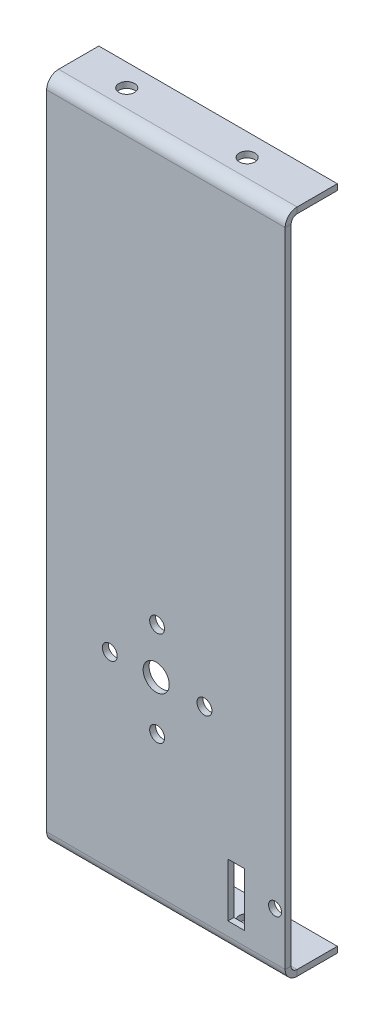
ISO-10303-21;
HEADER;
FILE_DESCRIPTION(('STEP AP214'),'2;1');
FILE_NAME('part.step','',(''),(''),'','','');
FILE_SCHEMA(('AUTOMOTIVE_DESIGN { 1 0 10303 214 1 1 1 1 }'));
ENDSEC;
DATA;
#1=APPLICATION_CONTEXT('core data for automotive mechanical design processes');
#2=APPLICATION_PROTOCOL_DEFINITION('international standard','automotive_design',2000,#1);
#3=PRODUCT_CONTEXT('',#1,'mechanical');
#4=PRODUCT('Part','Part','',(#3));
#5=PRODUCT_RELATED_PRODUCT_CATEGORY('part','',(#4));
#6=PRODUCT_DEFINITION_FORMATION('','',#4);
#7=PRODUCT_DEFINITION_CONTEXT('part definition',#1,'design');
#8=PRODUCT_DEFINITION('design','',#6,#7);
#9=PRODUCT_DEFINITION_SHAPE('','',#8);
#10=(LENGTH_UNIT() NAMED_UNIT(*) SI_UNIT(.MILLI.,.METRE.));
#11=(NAMED_UNIT(*) PLANE_ANGLE_UNIT() SI_UNIT($,.RADIAN.));
#12=(NAMED_UNIT(*) SI_UNIT($,.STERADIAN.) SOLID_ANGLE_UNIT());
#13=UNCERTAINTY_MEASURE_WITH_UNIT(LENGTH_MEASURE(1.E-05),#10,'distance_accuracy_value','');
#14=(GEOMETRIC_REPRESENTATION_CONTEXT(3) GLOBAL_UNCERTAINTY_ASSIGNED_CONTEXT((#13)) GLOBAL_UNIT_ASSIGNED_CONTEXT((#10,
#11,#12)) REPRESENTATION_CONTEXT('',''));
#15=CARTESIAN_POINT('',(0.,0.,0.));
#16=DIRECTION('',(0.,0.,1.));
#17=DIRECTION('',(1.,0.,0.));
#18=AXIS2_PLACEMENT_3D('',#15,#16,#17);
#19=CARTESIAN_POINT('',(0.,0.,-1.6));
#20=DIRECTION('',(0.,0.,-1.));
#21=DIRECTION('',(-1.,0.,0.));
#22=AXIS2_PLACEMENT_3D('',#19,#20,#21);
#23=PLANE('',#22);
#24=DIRECTION('',(0.,1.,0.));
#25=VECTOR('',#24,1.);
#26=CARTESIAN_POINT('',(48.6419969295721,0.,-1.6));
#27=LINE('',#26,#25);
#28=CARTESIAN_POINT('',(48.6419969295721,6.80327818943664,-1.6));
#29=VERTEX_POINT('',#28);
#30=CARTESIAN_POINT('',(48.6419969295721,21.1762425645532,-1.6));
#31=VERTEX_POINT('',#30);
#32=EDGE_CURVE('E226',#29,#31,#27,.T.);
#33=ORIENTED_EDGE('',*,*,#32,.F.);
#34=DIRECTION('',(-1.,0.,0.));
#35=VECTOR('',#34,1.);
#36=CARTESIAN_POINT('',(0.,6.80327818943664,-1.6));
#37=LINE('',#36,#35);
#38=CARTESIAN_POINT('',(53.1404056271276,6.80327818943664,-1.6));
#39=VERTEX_POINT('',#38);
#40=EDGE_CURVE('E219',#39,#29,#37,.T.);
#41=ORIENTED_EDGE('',*,*,#40,.F.);
#42=DIRECTION('',(0.,-1.,0.));
#43=VECTOR('',#42,1.);
#44=CARTESIAN_POINT('',(53.1404056271276,0.,-1.6));
#45=LINE('',#44,#43);
#46=CARTESIAN_POINT('',(53.1404056271276,21.1762425645532,-1.6));
#47=VERTEX_POINT('',#46);
#48=EDGE_CURVE('E199',#47,#39,#45,.T.);
#49=ORIENTED_EDGE('',*,*,#48,.F.);
#50=DIRECTION('',(1.,0.,0.));
#51=VECTOR('',#50,1.);
#52=CARTESIAN_POINT('',(0.,21.1762425645532,-1.6));
#53=LINE('',#52,#51);
#54=EDGE_CURVE('E224',#31,#47,#53,.T.);
#55=ORIENTED_EDGE('',*,*,#54,.F.);
#56=EDGE_LOOP('',(#33,#41,#49,#55));
#57=FACE_BOUND('',#56,.T.);
#58=CARTESIAN_POINT('',(29.384576346946,53.8122055407926,-1.6));
#59=DIRECTION('',(0.,0.,-1.));
#60=DIRECTION('',(-1.,0.,0.));
#61=AXIS2_PLACEMENT_3D('',#58,#59,#60);
#62=CIRCLE('',#61,3.5000000000002);
#63=CARTESIAN_POINT('',(25.8845763469458,53.8122055407926,-1.6));
#64=VERTEX_POINT('',#63);
#65=EDGE_CURVE('E231',#64,#64,#62,.T.);
#66=ORIENTED_EDGE('',*,*,#65,.F.);
#67=EDGE_LOOP('',(#66));
#68=FACE_BOUND('',#67,.T.);
#69=CARTESIAN_POINT('',(61.2911821742671,15.9999999999998,-1.60000000000005));
#70=DIRECTION('',(0.,0.,-1.));
#71=DIRECTION('',(-1.,0.,0.));
#72=AXIS2_PLACEMENT_3D('',#69,#70,#71);
#73=CIRCLE('',#72,1.75);
#74=CARTESIAN_POINT('',(59.5411821742671,15.9999999999998,-1.60000000000005));
#75=VERTEX_POINT('',#74);
#76=EDGE_CURVE('E261',#75,#75,#73,.T.);
#77=ORIENTED_EDGE('',*,*,#76,.F.);
#78=EDGE_LOOP('',(#77));
#79=FACE_BOUND('',#78,.T.);
#80=CARTESIAN_POINT('',(29.6396852912716,66.1685636075182,-1.60000000000005));
#81=DIRECTION('',(0.,0.,-1.));
#82=DIRECTION('',(-1.,0.,0.));
#83=AXIS2_PLACEMENT_3D('',#80,#81,#82);
#84=CIRCLE('',#83,2.);
#85=CARTESIAN_POINT('',(27.6396852912717,66.1685636075182,-1.60000000000005));
#86=VERTEX_POINT('',#85);
#87=EDGE_CURVE('E258',#86,#86,#84,.T.);
#88=ORIENTED_EDGE('',*,*,#87,.F.);
#89=EDGE_LOOP('',(#88));
#90=FACE_BOUND('',#89,.T.);
#91=CARTESIAN_POINT('',(16.9396852912716,53.4685636075182,-1.60000000000005));
#92=DIRECTION('',(0.,0.,-1.));
#93=DIRECTION('',(-1.,0.,0.));
#94=AXIS2_PLACEMENT_3D('',#91,#92,#93);
#95=CIRCLE('',#94,2.);
#96=CARTESIAN_POINT('',(14.9396852912716,53.4685636075182,-1.60000000000005));
#97=VERTEX_POINT('',#96);
#98=EDGE_CURVE('E255',#97,#97,#95,.T.);
#99=ORIENTED_EDGE('',*,*,#98,.F.);
#100=EDGE_LOOP('',(#99));
#101=FACE_BOUND('',#100,.T.);
#102=CARTESIAN_POINT('',(42.3396852912716,53.4685636075182,-1.60000000000005));
#103=DIRECTION('',(0.,0.,-1.));
#104=DIRECTION('',(-1.,0.,0.));
#105=AXIS2_PLACEMENT_3D('',#102,#103,#104);
#106=CIRCLE('',#105,2.);
#107=CARTESIAN_POINT('',(40.3396852912716,53.4685636075182,-1.60000000000005));
#108=VERTEX_POINT('',#107);
#109=EDGE_CURVE('E252',#108,#108,#106,.T.);
#110=ORIENTED_EDGE('',*,*,#109,.F.);
#111=EDGE_LOOP('',(#110));
#112=FACE_BOUND('',#111,.T.);
#113=CARTESIAN_POINT('',(29.6396852912716,40.7685636075182,-1.60000000000005));
#114=DIRECTION('',(0.,0.,-1.));
#115=DIRECTION('',(-1.,0.,0.));
#116=AXIS2_PLACEMENT_3D('',#113,#114,#115);
#117=CIRCLE('',#116,2.);
#118=CARTESIAN_POINT('',(27.6396852912717,40.7685636075182,-1.60000000000005));
#119=VERTEX_POINT('',#118);
#120=EDGE_CURVE('E238',#119,#119,#117,.T.);
#121=ORIENTED_EDGE('',*,*,#120,.F.);
#122=EDGE_LOOP('',(#121));
#123=FACE_BOUND('',#122,.T.);
#124=DIRECTION('',(0.,-1.,0.));
#125=VECTOR('',#124,1.);
#126=CARTESIAN_POINT('',(0.,0.,-1.6));
#127=LINE('',#126,#125);
#128=CARTESIAN_POINT('',(0.,175.6,-1.6));
#129=VERTEX_POINT('',#128);
#130=CARTESIAN_POINT('',(0.,3.19999999999999,-1.6));
#131=VERTEX_POINT('',#130);
#132=EDGE_CURVE('E87',#129,#131,#127,.T.);
#133=ORIENTED_EDGE('',*,*,#132,.F.);
#134=DIRECTION('',(1.,0.,0.));
#135=VECTOR('',#134,1.);
#136=CARTESIAN_POINT('',(64.,175.6,-1.6));
#137=LINE('',#136,#135);
#138=CARTESIAN_POINT('',(64.,175.6,-1.6));
#139=VERTEX_POINT('',#138);
#140=EDGE_CURVE('E326',#139,#129,#137,.F.);
#141=ORIENTED_EDGE('',*,*,#140,.F.);
#142=DIRECTION('',(0.,1.,0.));
#143=VECTOR('',#142,1.);
#144=CARTESIAN_POINT('',(64.,0.,-1.6));
#145=LINE('',#144,#143);
#146=CARTESIAN_POINT('',(64.,3.19999999999999,-1.6));
#147=VERTEX_POINT('',#146);
#148=EDGE_CURVE('E13',#147,#139,#145,.T.);
#149=ORIENTED_EDGE('',*,*,#148,.F.);
#150=DIRECTION('',(-1.,0.,0.));
#151=VECTOR('',#150,1.);
#152=CARTESIAN_POINT('',(0.,3.19999999999999,-1.6));
#153=LINE('',#152,#151);
#154=EDGE_CURVE('E379',#131,#147,#153,.F.);
#155=ORIENTED_EDGE('',*,*,#154,.F.);
#156=EDGE_LOOP('',(#133,#141,#149,#155));
#157=FACE_BOUND('',#156,.T.);
#158=ADVANCED_FACE('F78',(#57,#68,#79,#90,#101,#112,#123,#157),#23,.T.);
#159=CARTESIAN_POINT('',(0.,0.,0.));
#160=DIRECTION('',(0.,0.,-1.));
#161=DIRECTION('',(-1.,0.,0.));
#162=AXIS2_PLACEMENT_3D('',#159,#160,#161);
#163=PLANE('',#162);
#164=DIRECTION('',(1.,0.,0.));
#165=VECTOR('',#164,1.);
#166=CARTESIAN_POINT('',(48.6419969295721,6.80327818943664,0.));
#167=LINE('',#166,#165);
#168=CARTESIAN_POINT('',(48.6419969295721,6.80327818943664,0.));
#169=VERTEX_POINT('',#168);
#170=CARTESIAN_POINT('',(53.1404056271276,6.80327818943664,0.));
#171=VERTEX_POINT('',#170);
#172=EDGE_CURVE('E205',#169,#171,#167,.T.);
#173=ORIENTED_EDGE('',*,*,#172,.F.);
#174=DIRECTION('',(0.,-1.,0.));
#175=VECTOR('',#174,1.);
#176=CARTESIAN_POINT('',(48.6419969295721,21.1762425645532,0.));
#177=LINE('',#176,#175);
#178=CARTESIAN_POINT('',(48.6419969295721,21.1762425645532,0.));
#179=VERTEX_POINT('',#178);
#180=EDGE_CURVE('E103',#179,#169,#177,.T.);
#181=ORIENTED_EDGE('',*,*,#180,.F.);
#182=DIRECTION('',(-1.,0.,0.));
#183=VECTOR('',#182,1.);
#184=CARTESIAN_POINT('',(48.6419969295721,21.1762425645532,0.));
#185=LINE('',#184,#183);
#186=CARTESIAN_POINT('',(53.1404056271276,21.1762425645532,0.));
#187=VERTEX_POINT('',#186);
#188=EDGE_CURVE('E212',#187,#179,#185,.T.);
#189=ORIENTED_EDGE('',*,*,#188,.F.);
#190=DIRECTION('',(0.,1.,0.));
#191=VECTOR('',#190,1.);
#192=CARTESIAN_POINT('',(53.1404056271276,21.1762425645532,0.));
#193=LINE('',#192,#191);
#194=EDGE_CURVE('E196',#171,#187,#193,.T.);
#195=ORIENTED_EDGE('',*,*,#194,.F.);
#196=EDGE_LOOP('',(#173,#181,#189,#195));
#197=FACE_BOUND('',#196,.T.);
#198=CARTESIAN_POINT('',(29.384576346946,53.8122055407926,0.));
#199=DIRECTION('',(0.,0.,1.));
#200=DIRECTION('',(1.,0.,0.));
#201=AXIS2_PLACEMENT_3D('',#198,#199,#200);
#202=CIRCLE('',#201,3.5000000000002);
#203=CARTESIAN_POINT('',(32.8845763469462,53.8122055407926,0.));
#204=VERTEX_POINT('',#203);
#205=EDGE_CURVE('E228',#204,#204,#202,.T.);
#206=ORIENTED_EDGE('',*,*,#205,.F.);
#207=EDGE_LOOP('',(#206));
#208=FACE_BOUND('',#207,.T.);
#209=CARTESIAN_POINT('',(61.2911821742671,15.9999999999998,0.));
#210=DIRECTION('',(0.,0.,1.));
#211=DIRECTION('',(1.,0.,0.));
#212=AXIS2_PLACEMENT_3D('',#209,#210,#211);
#213=CIRCLE('',#212,1.75);
#214=CARTESIAN_POINT('',(63.0411821742671,15.9999999999998,0.));
#215=VERTEX_POINT('',#214);
#216=EDGE_CURVE('E235',#215,#215,#213,.T.);
#217=ORIENTED_EDGE('',*,*,#216,.F.);
#218=EDGE_LOOP('',(#217));
#219=FACE_BOUND('',#218,.T.);
#220=CARTESIAN_POINT('',(29.6396852912716,66.1685636075182,0.));
#221=DIRECTION('',(0.,0.,1.));
#222=DIRECTION('',(1.,0.,0.));
#223=AXIS2_PLACEMENT_3D('',#220,#221,#222);
#224=CIRCLE('',#223,2.);
#225=CARTESIAN_POINT('',(31.6396852912716,66.1685636075182,0.));
#226=VERTEX_POINT('',#225);
#227=EDGE_CURVE('E234',#226,#226,#224,.T.);
#228=ORIENTED_EDGE('',*,*,#227,.F.);
#229=EDGE_LOOP('',(#228));
#230=FACE_BOUND('',#229,.T.);
#231=CARTESIAN_POINT('',(16.9396852912716,53.4685636075182,0.));
#232=DIRECTION('',(0.,0.,1.));
#233=DIRECTION('',(1.,0.,0.));
#234=AXIS2_PLACEMENT_3D('',#231,#232,#233);
#235=CIRCLE('',#234,2.);
#236=CARTESIAN_POINT('',(18.9396852912716,53.4685636075182,0.));
#237=VERTEX_POINT('',#236);
#238=EDGE_CURVE('E240',#237,#237,#235,.T.);
#239=ORIENTED_EDGE('',*,*,#238,.F.);
#240=EDGE_LOOP('',(#239));
#241=FACE_BOUND('',#240,.T.);
#242=CARTESIAN_POINT('',(42.3396852912716,53.4685636075182,0.));
#243=DIRECTION('',(0.,0.,1.));
#244=DIRECTION('',(1.,0.,0.));
#245=AXIS2_PLACEMENT_3D('',#242,#243,#244);
#246=CIRCLE('',#245,2.);
#247=CARTESIAN_POINT('',(44.3396852912716,53.4685636075182,0.));
#248=VERTEX_POINT('',#247);
#249=EDGE_CURVE('E243',#248,#248,#246,.T.);
#250=ORIENTED_EDGE('',*,*,#249,.F.);
#251=EDGE_LOOP('',(#250));
#252=FACE_BOUND('',#251,.T.);
#253=CARTESIAN_POINT('',(29.6396852912716,40.7685636075182,0.));
#254=DIRECTION('',(0.,0.,1.));
#255=DIRECTION('',(1.,0.,0.));
#256=AXIS2_PLACEMENT_3D('',#253,#254,#255);
#257=CIRCLE('',#256,2.);
#258=CARTESIAN_POINT('',(31.6396852912716,40.7685636075182,0.));
#259=VERTEX_POINT('',#258);
#260=EDGE_CURVE('E239',#259,#259,#257,.T.);
#261=ORIENTED_EDGE('',*,*,#260,.F.);
#262=EDGE_LOOP('',(#261));
#263=FACE_BOUND('',#262,.T.);
#264=DIRECTION('',(1.,0.,0.));
#265=VECTOR('',#264,1.);
#266=CARTESIAN_POINT('',(64.,175.6,0.));
#267=LINE('',#266,#265);
#268=CARTESIAN_POINT('',(64.,175.6,0.));
#269=VERTEX_POINT('',#268);
#270=CARTESIAN_POINT('',(0.,175.6,0.));
#271=VERTEX_POINT('',#270);
#272=EDGE_CURVE('E314',#269,#271,#267,.F.);
#273=ORIENTED_EDGE('',*,*,#272,.T.);
#274=DIRECTION('',(0.,-1.,0.));
#275=VECTOR('',#274,1.);
#276=CARTESIAN_POINT('',(0.,0.,0.));
#277=LINE('',#276,#275);
#278=CARTESIAN_POINT('',(0.,3.19999999999999,0.));
#279=VERTEX_POINT('',#278);
#280=EDGE_CURVE('E387',#271,#279,#277,.T.);
#281=ORIENTED_EDGE('',*,*,#280,.T.);
#282=DIRECTION('',(-1.,0.,0.));
#283=VECTOR('',#282,1.);
#284=CARTESIAN_POINT('',(0.,3.19999999999999,0.));
#285=LINE('',#284,#283);
#286=CARTESIAN_POINT('',(64.,3.19999999999999,0.));
#287=VERTEX_POINT('',#286);
#288=EDGE_CURVE('E367',#279,#287,#285,.F.);
#289=ORIENTED_EDGE('',*,*,#288,.T.);
#290=DIRECTION('',(0.,1.,0.));
#291=VECTOR('',#290,1.);
#292=CARTESIAN_POINT('',(64.,0.,0.));
#293=LINE('',#292,#291);
#294=EDGE_CURVE('E390',#287,#269,#293,.T.);
#295=ORIENTED_EDGE('',*,*,#294,.T.);
#296=EDGE_LOOP('',(#273,#281,#289,#295));
#297=FACE_BOUND('',#296,.T.);
#298=ADVANCED_FACE('F209',(#197,#208,#219,#230,#241,#252,#263,#297),#163,.F.);
#299=CARTESIAN_POINT('',(64.,0.,-1.6));
#300=DIRECTION('',(1.,0.,0.));
#301=DIRECTION('',(0.,0.,-1.));
#302=AXIS2_PLACEMENT_3D('',#299,#300,#301);
#303=PLANE('',#302);
#304=ORIENTED_EDGE('',*,*,#148,.T.);
#305=DIRECTION('',(0.,0.,1.));
#306=VECTOR('',#305,1.);
#307=CARTESIAN_POINT('',(64.,175.6,-1.6));
#308=LINE('',#307,#306);
#309=EDGE_CURVE('E320',#139,#269,#308,.T.);
#310=ORIENTED_EDGE('',*,*,#309,.T.);
#311=ORIENTED_EDGE('',*,*,#294,.F.);
#312=DIRECTION('',(0.,0.,1.));
#313=VECTOR('',#312,1.);
#314=CARTESIAN_POINT('',(64.,3.19999999999999,-1.6));
#315=LINE('',#314,#313);
#316=EDGE_CURVE('E384',#147,#287,#315,.T.);
#317=ORIENTED_EDGE('',*,*,#316,.F.);
#318=EDGE_LOOP('',(#304,#310,#311,#317));
#319=FACE_BOUND('',#318,.T.);
#320=ADVANCED_FACE('F447',(#319),#303,.T.);
#321=CARTESIAN_POINT('',(0.,0.,-1.6));
#322=DIRECTION('',(-1.,0.,0.));
#323=DIRECTION('',(0.,0.,1.));
#324=AXIS2_PLACEMENT_3D('',#321,#322,#323);
#325=PLANE('',#324);
#326=DIRECTION('',(0.,0.,1.));
#327=VECTOR('',#326,1.);
#328=CARTESIAN_POINT('',(0.,175.6,-1.6));
#329=LINE('',#328,#327);
#330=EDGE_CURVE('E331',#129,#271,#329,.T.);
#331=ORIENTED_EDGE('',*,*,#330,.F.);
#332=ORIENTED_EDGE('',*,*,#132,.T.);
#333=DIRECTION('',(0.,0.,1.));
#334=VECTOR('',#333,1.);
#335=CARTESIAN_POINT('',(0.,3.19999999999999,-1.6));
#336=LINE('',#335,#334);
#337=EDGE_CURVE('E373',#131,#279,#336,.T.);
#338=ORIENTED_EDGE('',*,*,#337,.T.);
#339=ORIENTED_EDGE('',*,*,#280,.F.);
#340=EDGE_LOOP('',(#331,#332,#338,#339));
#341=FACE_BOUND('',#340,.T.);
#342=ADVANCED_FACE('F80',(#341),#325,.T.);
#343=CARTESIAN_POINT('',(64.,3.19999999999999,-3.2));
#344=DIRECTION('',(1.,0.,0.));
#345=DIRECTION('',(0.,0.,-1.));
#346=AXIS2_PLACEMENT_3D('',#343,#344,#345);
#347=PLANE('',#346);
#348=DIRECTION('',(0.,1.,0.));
#349=VECTOR('',#348,1.);
#350=CARTESIAN_POINT('',(64.,0.,-3.19999999999999));
#351=LINE('',#350,#349);
#352=CARTESIAN_POINT('',(64.,1.59999999999999,-3.19999999999999));
#353=VERTEX_POINT('',#352);
#354=CARTESIAN_POINT('',(63.9999999999999,0.,-3.19999999999999));
#355=VERTEX_POINT('',#354);
#356=EDGE_CURVE('E334',#353,#355,#351,.F.);
#357=ORIENTED_EDGE('',*,*,#356,.F.);
#358=CARTESIAN_POINT('',(64.,3.19999999999999,-3.2));
#359=DIRECTION('',(-1.,0.,0.));
#360=DIRECTION('',(0.,0.,1.));
#361=AXIS2_PLACEMENT_3D('',#358,#359,#360);
#362=CIRCLE('',#361,1.6);
#363=EDGE_CURVE('E376',#147,#353,#362,.F.);
#364=ORIENTED_EDGE('',*,*,#363,.F.);
#365=ORIENTED_EDGE('',*,*,#316,.T.);
#366=CARTESIAN_POINT('',(63.9999999999999,3.19999999999999,-3.2));
#367=DIRECTION('',(-1.,0.,0.));
#368=DIRECTION('',(0.,0.,1.));
#369=AXIS2_PLACEMENT_3D('',#366,#367,#368);
#370=CIRCLE('',#369,3.2);
#371=EDGE_CURVE('E369',#287,#355,#370,.F.);
#372=ORIENTED_EDGE('',*,*,#371,.T.);
#373=EDGE_LOOP('',(#357,#364,#365,#372));
#374=FACE_BOUND('',#373,.T.);
#375=ADVANCED_FACE('F459',(#374),#347,.T.);
#376=CARTESIAN_POINT('',(0.,3.19999999999999,-3.2));
#377=DIRECTION('',(1.,0.,0.));
#378=DIRECTION('',(0.,0.,-1.));
#379=AXIS2_PLACEMENT_3D('',#376,#377,#378);
#380=PLANE('',#379);
#381=CARTESIAN_POINT('',(0.,3.19999999999999,-3.2));
#382=DIRECTION('',(-1.,0.,0.));
#383=DIRECTION('',(0.,0.,1.));
#384=AXIS2_PLACEMENT_3D('',#381,#382,#383);
#385=CIRCLE('',#384,1.6);
#386=CARTESIAN_POINT('',(0.,1.59999999999999,-3.19999999999999));
#387=VERTEX_POINT('',#386);
#388=EDGE_CURVE('E340',#387,#131,#385,.T.);
#389=ORIENTED_EDGE('',*,*,#388,.F.);
#390=DIRECTION('',(0.,1.,0.));
#391=VECTOR('',#390,1.);
#392=CARTESIAN_POINT('',(0.,1.59999999999999,-3.19999999999999));
#393=LINE('',#392,#391);
#394=CARTESIAN_POINT('',(0.,0.,-3.19999999999999));
#395=VERTEX_POINT('',#394);
#396=EDGE_CURVE('E360',#387,#395,#393,.F.);
#397=ORIENTED_EDGE('',*,*,#396,.T.);
#398=CARTESIAN_POINT('',(0.,3.19999999999999,-3.2));
#399=DIRECTION('',(-1.,0.,0.));
#400=DIRECTION('',(0.,0.,1.));
#401=AXIS2_PLACEMENT_3D('',#398,#399,#400);
#402=CIRCLE('',#401,3.2);
#403=EDGE_CURVE('E370',#395,#279,#402,.T.);
#404=ORIENTED_EDGE('',*,*,#403,.T.);
#405=ORIENTED_EDGE('',*,*,#337,.F.);
#406=EDGE_LOOP('',(#389,#397,#404,#405));
#407=FACE_BOUND('',#406,.T.);
#408=ADVANCED_FACE('F452',(#407),#380,.F.);
#409=CARTESIAN_POINT('',(0.,3.19999999999999,-3.2));
#410=DIRECTION('',(-1.,0.,0.));
#411=DIRECTION('',(0.,-1.,0.));
#412=AXIS2_PLACEMENT_3D('',#409,#410,#411);
#413=CYLINDRICAL_SURFACE('',#412,3.2);
#414=ORIENTED_EDGE('',*,*,#288,.F.);
#415=ORIENTED_EDGE('',*,*,#403,.F.);
#416=DIRECTION('',(-1.,0.,0.));
#417=VECTOR('',#416,1.);
#418=CARTESIAN_POINT('',(64.,0.,-3.19999999999999));
#419=LINE('',#418,#417);
#420=EDGE_CURVE('E358',#395,#355,#419,.F.);
#421=ORIENTED_EDGE('',*,*,#420,.T.);
#422=ORIENTED_EDGE('',*,*,#371,.F.);
#423=EDGE_LOOP('',(#414,#415,#421,#422));
#424=FACE_BOUND('',#423,.T.);
#425=ADVANCED_FACE('F479',(#424),#413,.T.);
#426=CARTESIAN_POINT('',(0.,3.19999999999999,-3.2));
#427=DIRECTION('',(-1.,0.,0.));
#428=DIRECTION('',(0.,-1.,0.));
#429=AXIS2_PLACEMENT_3D('',#426,#427,#428);
#430=CYLINDRICAL_SURFACE('',#429,1.6);
#431=ORIENTED_EDGE('',*,*,#154,.T.);
#432=ORIENTED_EDGE('',*,*,#363,.T.);
#433=DIRECTION('',(-1.,0.,0.));
#434=VECTOR('',#433,1.);
#435=CARTESIAN_POINT('',(64.,1.59999999999999,-3.19999999999999));
#436=LINE('',#435,#434);
#437=EDGE_CURVE('E363',#353,#387,#436,.T.);
#438=ORIENTED_EDGE('',*,*,#437,.T.);
#439=ORIENTED_EDGE('',*,*,#388,.T.);
#440=EDGE_LOOP('',(#431,#432,#438,#439));
#441=FACE_BOUND('',#440,.T.);
#442=ADVANCED_FACE('F500',(#441),#430,.F.);
#443=CARTESIAN_POINT('',(0.,0.,-14.));
#444=DIRECTION('',(1.,0.,0.));
#445=DIRECTION('',(0.,0.,-1.));
#446=AXIS2_PLACEMENT_3D('',#443,#444,#445);
#447=PLANE('',#446);
#448=ORIENTED_EDGE('',*,*,#396,.F.);
#449=DIRECTION('',(0.,0.,1.));
#450=VECTOR('',#449,1.);
#451=CARTESIAN_POINT('',(0.,1.59999999999996,-14.));
#452=LINE('',#451,#450);
#453=CARTESIAN_POINT('',(0.,1.59999999999996,-14.));
#454=VERTEX_POINT('',#453);
#455=EDGE_CURVE('E356',#387,#454,#452,.F.);
#456=ORIENTED_EDGE('',*,*,#455,.T.);
#457=DIRECTION('',(0.,1.,0.));
#458=VECTOR('',#457,1.);
#459=CARTESIAN_POINT('',(0.,0.,-14.));
#460=LINE('',#459,#458);
#461=CARTESIAN_POINT('',(0.,0.,-14.));
#462=VERTEX_POINT('',#461);
#463=EDGE_CURVE('E337',#462,#454,#460,.T.);
#464=ORIENTED_EDGE('',*,*,#463,.F.);
#465=DIRECTION('',(0.,0.,-1.));
#466=VECTOR('',#465,1.);
#467=CARTESIAN_POINT('',(0.,0.,0.));
#468=LINE('',#467,#466);
#469=EDGE_CURVE('E349',#395,#462,#468,.T.);
#470=ORIENTED_EDGE('',*,*,#469,.F.);
#471=EDGE_LOOP('',(#448,#456,#464,#470));
#472=FACE_BOUND('',#471,.T.);
#473=ADVANCED_FACE('F488',(#472),#447,.F.);
#474=CARTESIAN_POINT('',(64.,0.,-1.59999999999999));
#475=DIRECTION('',(-1.,0.,0.));
#476=DIRECTION('',(0.,0.,1.));
#477=AXIS2_PLACEMENT_3D('',#474,#475,#476);
#478=PLANE('',#477);
#479=ORIENTED_EDGE('',*,*,#356,.T.);
#480=DIRECTION('',(0.,0.,1.));
#481=VECTOR('',#480,1.);
#482=CARTESIAN_POINT('',(64.,0.,0.));
#483=LINE('',#482,#481);
#484=CARTESIAN_POINT('',(64.,0.,-14.));
#485=VERTEX_POINT('',#484);
#486=EDGE_CURVE('E344',#485,#355,#483,.T.);
#487=ORIENTED_EDGE('',*,*,#486,.F.);
#488=DIRECTION('',(0.,1.,0.));
#489=VECTOR('',#488,1.);
#490=CARTESIAN_POINT('',(64.,0.,-14.));
#491=LINE('',#490,#489);
#492=CARTESIAN_POINT('',(64.,1.59999999999996,-14.));
#493=VERTEX_POINT('',#492);
#494=EDGE_CURVE('E341',#485,#493,#491,.T.);
#495=ORIENTED_EDGE('',*,*,#494,.T.);
#496=DIRECTION('',(0.,0.,-1.));
#497=VECTOR('',#496,1.);
#498=CARTESIAN_POINT('',(64.,1.6,-1.6));
#499=LINE('',#498,#497);
#500=EDGE_CURVE('E351',#493,#353,#499,.F.);
#501=ORIENTED_EDGE('',*,*,#500,.T.);
#502=EDGE_LOOP('',(#479,#487,#495,#501));
#503=FACE_BOUND('',#502,.T.);
#504=ADVANCED_FACE('F497',(#503),#478,.F.);
#505=CARTESIAN_POINT('',(0.,0.,0.));
#506=DIRECTION('',(0.,1.,0.));
#507=DIRECTION('',(0.,0.,1.));
#508=AXIS2_PLACEMENT_3D('',#505,#506,#507);
#509=PLANE('',#508);
#510=CARTESIAN_POINT('',(13.4918119112979,0.,-8.));
#511=DIRECTION('',(0.,-1.,0.));
#512=DIRECTION('',(0.,0.,-1.));
#513=AXIS2_PLACEMENT_3D('',#510,#511,#512);
#514=CIRCLE('',#513,2.09999999996991);
#515=CARTESIAN_POINT('',(13.4918119112979,0.,-10.0999999999699));
#516=VERTEX_POINT('',#515);
#517=EDGE_CURVE('E265',#516,#516,#514,.T.);
#518=ORIENTED_EDGE('',*,*,#517,.F.);
#519=EDGE_LOOP('',(#518));
#520=FACE_BOUND('',#519,.T.);
#521=CARTESIAN_POINT('',(45.7911821742672,0.,-8.));
#522=DIRECTION('',(0.,-1.,0.));
#523=DIRECTION('',(0.,0.,-1.));
#524=AXIS2_PLACEMENT_3D('',#521,#522,#523);
#525=CIRCLE('',#524,2.09999999996991);
#526=CARTESIAN_POINT('',(45.7911821742672,0.,-10.0999999999699));
#527=VERTEX_POINT('',#526);
#528=EDGE_CURVE('E264',#527,#527,#525,.T.);
#529=ORIENTED_EDGE('',*,*,#528,.F.);
#530=EDGE_LOOP('',(#529));
#531=FACE_BOUND('',#530,.T.);
#532=ORIENTED_EDGE('',*,*,#420,.F.);
#533=ORIENTED_EDGE('',*,*,#469,.T.);
#534=DIRECTION('',(1.,0.,0.));
#535=VECTOR('',#534,1.);
#536=CARTESIAN_POINT('',(0.,0.,-14.));
#537=LINE('',#536,#535);
#538=EDGE_CURVE('E347',#462,#485,#537,.T.);
#539=ORIENTED_EDGE('',*,*,#538,.T.);
#540=ORIENTED_EDGE('',*,*,#486,.T.);
#541=EDGE_LOOP('',(#532,#533,#539,#540));
#542=FACE_BOUND('',#541,.T.);
#543=ADVANCED_FACE('F483',(#520,#531,#542),#509,.F.);
#544=CARTESIAN_POINT('',(0.,1.60000000000001,0.));
#545=DIRECTION('',(0.,1.,0.));
#546=DIRECTION('',(0.,0.,1.));
#547=AXIS2_PLACEMENT_3D('',#544,#545,#546);
#548=PLANE('',#547);
#549=CARTESIAN_POINT('',(13.4918119112979,1.60000000000005,-8.00000000000001));
#550=DIRECTION('',(0.,1.,0.));
#551=DIRECTION('',(0.,0.,1.));
#552=AXIS2_PLACEMENT_3D('',#549,#550,#551);
#553=CIRCLE('',#552,2.09999999996991);
#554=CARTESIAN_POINT('',(13.4918119112979,1.60000000000005,-5.9000000000301));
#555=VERTEX_POINT('',#554);
#556=EDGE_CURVE('E280',#555,#555,#553,.T.);
#557=ORIENTED_EDGE('',*,*,#556,.F.);
#558=EDGE_LOOP('',(#557));
#559=FACE_BOUND('',#558,.T.);
#560=CARTESIAN_POINT('',(45.7911821742672,1.60000000000005,-8.));
#561=DIRECTION('',(0.,1.,0.));
#562=DIRECTION('',(0.,0.,1.));
#563=AXIS2_PLACEMENT_3D('',#560,#561,#562);
#564=CIRCLE('',#563,2.09999999996991);
#565=CARTESIAN_POINT('',(45.7911821742672,1.60000000000005,-5.9000000000301));
#566=VERTEX_POINT('',#565);
#567=EDGE_CURVE('E274',#566,#566,#564,.T.);
#568=ORIENTED_EDGE('',*,*,#567,.F.);
#569=EDGE_LOOP('',(#568));
#570=FACE_BOUND('',#569,.T.);
#571=ORIENTED_EDGE('',*,*,#455,.F.);
#572=ORIENTED_EDGE('',*,*,#437,.F.);
#573=ORIENTED_EDGE('',*,*,#500,.F.);
#574=DIRECTION('',(-1.,0.,0.));
#575=VECTOR('',#574,1.);
#576=CARTESIAN_POINT('',(64.,1.59999999999996,-14.));
#577=LINE('',#576,#575);
#578=EDGE_CURVE('E354',#454,#493,#577,.F.);
#579=ORIENTED_EDGE('',*,*,#578,.F.);
#580=EDGE_LOOP('',(#571,#572,#573,#579));
#581=FACE_BOUND('',#580,.T.);
#582=ADVANCED_FACE('F503',(#559,#570,#581),#548,.T.);
#583=CARTESIAN_POINT('',(64.,0.,-14.));
#584=DIRECTION('',(0.,0.,1.));
#585=DIRECTION('',(0.,-1.,0.));
#586=AXIS2_PLACEMENT_3D('',#583,#584,#585);
#587=PLANE('',#586);
#588=ORIENTED_EDGE('',*,*,#578,.T.);
#589=ORIENTED_EDGE('',*,*,#494,.F.);
#590=ORIENTED_EDGE('',*,*,#538,.F.);
#591=ORIENTED_EDGE('',*,*,#463,.T.);
#592=EDGE_LOOP('',(#588,#589,#590,#591));
#593=FACE_BOUND('',#592,.T.);
#594=ADVANCED_FACE('F494',(#593),#587,.F.);
#595=CARTESIAN_POINT('',(0.,175.6,-3.19999999999999));
#596=DIRECTION('',(-1.,0.,0.));
#597=DIRECTION('',(0.,0.,1.));
#598=AXIS2_PLACEMENT_3D('',#595,#596,#597);
#599=PLANE('',#598);
#600=DIRECTION('',(0.,-1.,0.));
#601=VECTOR('',#600,1.);
#602=CARTESIAN_POINT('',(0.,178.8,-3.19999999999997));
#603=LINE('',#602,#601);
#604=CARTESIAN_POINT('',(0.,177.2,-3.19999999999998));
#605=VERTEX_POINT('',#604);
#606=CARTESIAN_POINT('',(0.,178.8,-3.19999999999997));
#607=VERTEX_POINT('',#606);
#608=EDGE_CURVE('E283',#605,#607,#603,.F.);
#609=ORIENTED_EDGE('',*,*,#608,.F.);
#610=CARTESIAN_POINT('',(0.,175.6,-3.19999999999999));
#611=DIRECTION('',(1.,0.,0.));
#612=DIRECTION('',(0.,0.,-1.));
#613=AXIS2_PLACEMENT_3D('',#610,#611,#612);
#614=CIRCLE('',#613,1.59999999999999);
#615=EDGE_CURVE('E323',#129,#605,#614,.F.);
#616=ORIENTED_EDGE('',*,*,#615,.F.);
#617=ORIENTED_EDGE('',*,*,#330,.T.);
#618=CARTESIAN_POINT('',(0.,175.6,-3.19999999999999));
#619=DIRECTION('',(1.,0.,0.));
#620=DIRECTION('',(0.,0.,-1.));
#621=AXIS2_PLACEMENT_3D('',#618,#619,#620);
#622=CIRCLE('',#621,3.19999999999999);
#623=EDGE_CURVE('E316',#271,#607,#622,.F.);
#624=ORIENTED_EDGE('',*,*,#623,.T.);
#625=EDGE_LOOP('',(#609,#616,#617,#624));
#626=FACE_BOUND('',#625,.T.);
#627=ADVANCED_FACE('F426',(#626),#599,.T.);
#628=CARTESIAN_POINT('',(64.,175.6,-3.19999999999999));
#629=DIRECTION('',(-1.,0.,0.));
#630=DIRECTION('',(0.,0.,1.));
#631=AXIS2_PLACEMENT_3D('',#628,#629,#630);
#632=PLANE('',#631);
#633=CARTESIAN_POINT('',(64.,175.6,-3.19999999999999));
#634=DIRECTION('',(1.,0.,0.));
#635=DIRECTION('',(0.,0.,-1.));
#636=AXIS2_PLACEMENT_3D('',#633,#634,#635);
#637=CIRCLE('',#636,1.59999999999999);
#638=CARTESIAN_POINT('',(64.,177.2,-3.19999999999998));
#639=VERTEX_POINT('',#638);
#640=EDGE_CURVE('E287',#639,#139,#637,.T.);
#641=ORIENTED_EDGE('',*,*,#640,.F.);
#642=DIRECTION('',(0.,-1.,0.));
#643=VECTOR('',#642,1.);
#644=CARTESIAN_POINT('',(64.,177.2,-3.19999999999998));
#645=LINE('',#644,#643);
#646=CARTESIAN_POINT('',(64.,178.8,-3.19999999999997));
#647=VERTEX_POINT('',#646);
#648=EDGE_CURVE('E307',#639,#647,#645,.F.);
#649=ORIENTED_EDGE('',*,*,#648,.T.);
#650=CARTESIAN_POINT('',(64.,175.6,-3.19999999999999));
#651=DIRECTION('',(1.,0.,0.));
#652=DIRECTION('',(0.,0.,-1.));
#653=AXIS2_PLACEMENT_3D('',#650,#651,#652);
#654=CIRCLE('',#653,3.19999999999999);
#655=EDGE_CURVE('E317',#647,#269,#654,.T.);
#656=ORIENTED_EDGE('',*,*,#655,.T.);
#657=ORIENTED_EDGE('',*,*,#309,.F.);
#658=EDGE_LOOP('',(#641,#649,#656,#657));
#659=FACE_BOUND('',#658,.T.);
#660=ADVANCED_FACE('F468',(#659),#632,.F.);
#661=CARTESIAN_POINT('',(64.,175.6,-3.19999999999999));
#662=DIRECTION('',(1.,0.,0.));
#663=DIRECTION('',(0.,1.,0.));
#664=AXIS2_PLACEMENT_3D('',#661,#662,#663);
#665=CYLINDRICAL_SURFACE('',#664,3.19999999999999);
#666=ORIENTED_EDGE('',*,*,#272,.F.);
#667=ORIENTED_EDGE('',*,*,#655,.F.);
#668=DIRECTION('',(1.,0.,0.));
#669=VECTOR('',#668,1.);
#670=CARTESIAN_POINT('',(0.,178.8,-3.19999999999997));
#671=LINE('',#670,#669);
#672=EDGE_CURVE('E305',#647,#607,#671,.F.);
#673=ORIENTED_EDGE('',*,*,#672,.T.);
#674=ORIENTED_EDGE('',*,*,#623,.F.);
#675=EDGE_LOOP('',(#666,#667,#673,#674));
#676=FACE_BOUND('',#675,.T.);
#677=ADVANCED_FACE('F424',(#676),#665,.T.);
#678=CARTESIAN_POINT('',(64.,175.6,-3.19999999999999));
#679=DIRECTION('',(1.,0.,0.));
#680=DIRECTION('',(0.,1.,0.));
#681=AXIS2_PLACEMENT_3D('',#678,#679,#680);
#682=CYLINDRICAL_SURFACE('',#681,1.59999999999999);
#683=ORIENTED_EDGE('',*,*,#140,.T.);
#684=ORIENTED_EDGE('',*,*,#615,.T.);
#685=DIRECTION('',(1.,0.,0.));
#686=VECTOR('',#685,1.);
#687=CARTESIAN_POINT('',(0.,177.2,-3.19999999999998));
#688=LINE('',#687,#686);
#689=EDGE_CURVE('E310',#605,#639,#688,.T.);
#690=ORIENTED_EDGE('',*,*,#689,.T.);
#691=ORIENTED_EDGE('',*,*,#640,.T.);
#692=EDGE_LOOP('',(#683,#684,#690,#691));
#693=FACE_BOUND('',#692,.T.);
#694=ADVANCED_FACE('F438',(#693),#682,.F.);
#695=CARTESIAN_POINT('',(64.,178.8,-14.));
#696=DIRECTION('',(-1.,0.,0.));
#697=DIRECTION('',(0.,0.,1.));
#698=AXIS2_PLACEMENT_3D('',#695,#696,#697);
#699=PLANE('',#698);
#700=ORIENTED_EDGE('',*,*,#648,.F.);
#701=DIRECTION('',(0.,0.,1.));
#702=VECTOR('',#701,1.);
#703=CARTESIAN_POINT('',(64.,177.2,-14.));
#704=LINE('',#703,#702);
#705=CARTESIAN_POINT('',(64.,177.2,-14.));
#706=VERTEX_POINT('',#705);
#707=EDGE_CURVE('E303',#639,#706,#704,.F.);
#708=ORIENTED_EDGE('',*,*,#707,.T.);
#709=DIRECTION('',(0.,-1.,0.));
#710=VECTOR('',#709,1.);
#711=CARTESIAN_POINT('',(64.,178.8,-14.));
#712=LINE('',#711,#710);
#713=CARTESIAN_POINT('',(64.,178.8,-14.));
#714=VERTEX_POINT('',#713);
#715=EDGE_CURVE('E284',#714,#706,#712,.T.);
#716=ORIENTED_EDGE('',*,*,#715,.F.);
#717=DIRECTION('',(0.,0.,-1.));
#718=VECTOR('',#717,1.);
#719=CARTESIAN_POINT('',(64.,178.8,8.06021357250931E-13));
#720=LINE('',#719,#718);
#721=EDGE_CURVE('E296',#647,#714,#720,.T.);
#722=ORIENTED_EDGE('',*,*,#721,.F.);
#723=EDGE_LOOP('',(#700,#708,#716,#722));
#724=FACE_BOUND('',#723,.T.);
#725=ADVANCED_FACE('F413',(#724),#699,.F.);
#726=CARTESIAN_POINT('',(0.,178.8,-1.59999999999999));
#727=DIRECTION('',(1.,0.,0.));
#728=DIRECTION('',(0.,0.,-1.));
#729=AXIS2_PLACEMENT_3D('',#726,#727,#728);
#730=PLANE('',#729);
#731=ORIENTED_EDGE('',*,*,#608,.T.);
#732=DIRECTION('',(0.,0.,1.));
#733=VECTOR('',#732,1.);
#734=CARTESIAN_POINT('',(0.,178.8,8.06021357250931E-13));
#735=LINE('',#734,#733);
#736=CARTESIAN_POINT('',(0.,178.8,-14.));
#737=VERTEX_POINT('',#736);
#738=EDGE_CURVE('E291',#737,#607,#735,.T.);
#739=ORIENTED_EDGE('',*,*,#738,.F.);
#740=DIRECTION('',(0.,-1.,0.));
#741=VECTOR('',#740,1.);
#742=CARTESIAN_POINT('',(0.,178.8,-14.));
#743=LINE('',#742,#741);
#744=CARTESIAN_POINT('',(0.,177.2,-14.));
#745=VERTEX_POINT('',#744);
#746=EDGE_CURVE('E288',#737,#745,#743,.T.);
#747=ORIENTED_EDGE('',*,*,#746,.T.);
#748=DIRECTION('',(0.,0.,-1.));
#749=VECTOR('',#748,1.);
#750=CARTESIAN_POINT('',(0.,177.2,-1.6));
#751=LINE('',#750,#749);
#752=EDGE_CURVE('E298',#745,#605,#751,.F.);
#753=ORIENTED_EDGE('',*,*,#752,.T.);
#754=EDGE_LOOP('',(#731,#739,#747,#753));
#755=FACE_BOUND('',#754,.T.);
#756=ADVANCED_FACE('F429',(#755),#730,.F.);
#757=CARTESIAN_POINT('',(0.,178.8,8.06021357250931E-13));
#758=DIRECTION('',(0.,-1.,0.));
#759=DIRECTION('',(0.,0.,-1.));
#760=AXIS2_PLACEMENT_3D('',#757,#758,#759);
#761=PLANE('',#760);
#762=CARTESIAN_POINT('',(13.4918119112979,178.8,-8.00000000000063));
#763=DIRECTION('',(0.,-1.,0.));
#764=DIRECTION('',(0.,0.,-1.));
#765=AXIS2_PLACEMENT_3D('',#762,#763,#764);
#766=CIRCLE('',#765,2.09999999996991);
#767=CARTESIAN_POINT('',(13.4918119112979,178.8,-10.0999999999705));
#768=VERTEX_POINT('',#767);
#769=EDGE_CURVE('E277',#768,#768,#766,.T.);
#770=ORIENTED_EDGE('',*,*,#769,.T.);
#771=EDGE_LOOP('',(#770));
#772=FACE_BOUND('',#771,.T.);
#773=CARTESIAN_POINT('',(45.7911821742672,178.8,-8.00000000000062));
#774=DIRECTION('',(0.,-1.,0.));
#775=DIRECTION('',(0.,0.,-1.));
#776=AXIS2_PLACEMENT_3D('',#773,#774,#775);
#777=CIRCLE('',#776,2.09999999996991);
#778=CARTESIAN_POINT('',(45.7911821742672,178.8,-10.0999999999705));
#779=VERTEX_POINT('',#778);
#780=EDGE_CURVE('E271',#779,#779,#777,.T.);
#781=ORIENTED_EDGE('',*,*,#780,.T.);
#782=EDGE_LOOP('',(#781));
#783=FACE_BOUND('',#782,.T.);
#784=ORIENTED_EDGE('',*,*,#672,.F.);
#785=ORIENTED_EDGE('',*,*,#721,.T.);
#786=DIRECTION('',(-1.,0.,0.));
#787=VECTOR('',#786,1.);
#788=CARTESIAN_POINT('',(0.,178.8,-14.));
#789=LINE('',#788,#787);
#790=EDGE_CURVE('E294',#714,#737,#789,.T.);
#791=ORIENTED_EDGE('',*,*,#790,.T.);
#792=ORIENTED_EDGE('',*,*,#738,.T.);
#793=EDGE_LOOP('',(#784,#785,#791,#792));
#794=FACE_BOUND('',#793,.T.);
#795=ADVANCED_FACE('F403',(#772,#783,#794),#761,.F.);
#796=CARTESIAN_POINT('',(0.,177.2,8.00434987108782E-13));
#797=DIRECTION('',(0.,-1.,0.));
#798=DIRECTION('',(0.,0.,-1.));
#799=AXIS2_PLACEMENT_3D('',#796,#797,#798);
#800=PLANE('',#799);
#801=CARTESIAN_POINT('',(13.4918119112979,177.2,-8.00000000000062));
#802=DIRECTION('',(0.,-1.,0.));
#803=DIRECTION('',(0.,0.,-1.));
#804=AXIS2_PLACEMENT_3D('',#801,#802,#803);
#805=CIRCLE('',#804,2.09999999996991);
#806=CARTESIAN_POINT('',(13.4918119112979,177.2,-10.0999999999705));
#807=VERTEX_POINT('',#806);
#808=EDGE_CURVE('E82',#807,#807,#805,.T.);
#809=ORIENTED_EDGE('',*,*,#808,.F.);
#810=EDGE_LOOP('',(#809));
#811=FACE_BOUND('',#810,.T.);
#812=CARTESIAN_POINT('',(45.7911821742672,177.2,-8.00000000000062));
#813=DIRECTION('',(0.,-1.,0.));
#814=DIRECTION('',(0.,0.,-1.));
#815=AXIS2_PLACEMENT_3D('',#812,#813,#814);
#816=CIRCLE('',#815,2.09999999996991);
#817=CARTESIAN_POINT('',(45.7911821742672,177.2,-10.0999999999705));
#818=VERTEX_POINT('',#817);
#819=EDGE_CURVE('E268',#818,#818,#816,.T.);
#820=ORIENTED_EDGE('',*,*,#819,.F.);
#821=EDGE_LOOP('',(#820));
#822=FACE_BOUND('',#821,.T.);
#823=ORIENTED_EDGE('',*,*,#707,.F.);
#824=ORIENTED_EDGE('',*,*,#689,.F.);
#825=ORIENTED_EDGE('',*,*,#752,.F.);
#826=DIRECTION('',(1.,0.,0.));
#827=VECTOR('',#826,1.);
#828=CARTESIAN_POINT('',(0.,177.2,-14.));
#829=LINE('',#828,#827);
#830=EDGE_CURVE('E301',#706,#745,#829,.F.);
#831=ORIENTED_EDGE('',*,*,#830,.F.);
#832=EDGE_LOOP('',(#823,#824,#825,#831));
#833=FACE_BOUND('',#832,.T.);
#834=ADVANCED_FACE('F399',(#811,#822,#833),#800,.T.);
#835=CARTESIAN_POINT('',(0.,178.8,-14.));
#836=DIRECTION('',(0.,0.,1.));
#837=DIRECTION('',(0.,-1.,0.));
#838=AXIS2_PLACEMENT_3D('',#835,#836,#837);
#839=PLANE('',#838);
#840=ORIENTED_EDGE('',*,*,#830,.T.);
#841=ORIENTED_EDGE('',*,*,#746,.F.);
#842=ORIENTED_EDGE('',*,*,#790,.F.);
#843=ORIENTED_EDGE('',*,*,#715,.T.);
#844=EDGE_LOOP('',(#840,#841,#842,#843));
#845=FACE_BOUND('',#844,.T.);
#846=ADVANCED_FACE('F402',(#845),#839,.F.);
#847=CARTESIAN_POINT('',(45.7911821742672,1000.,-8.00000000000349));
#848=DIRECTION('',(0.,-1.,0.));
#849=DIRECTION('',(0.,0.,-1.));
#850=AXIS2_PLACEMENT_3D('',#847,#848,#849);
#851=CYLINDRICAL_SURFACE('',#850,2.09999999996991);
#852=ORIENTED_EDGE('',*,*,#819,.T.);
#853=EDGE_LOOP('',(#852));
#854=FACE_BOUND('',#853,.T.);
#855=ORIENTED_EDGE('',*,*,#780,.F.);
#856=EDGE_LOOP('',(#855));
#857=FACE_BOUND('',#856,.T.);
#858=ADVANCED_FACE('F396',(#854,#857),#851,.F.);
#859=CARTESIAN_POINT('',(13.4918119112979,1000.,-8.00000000000349));
#860=DIRECTION('',(0.,-1.,0.));
#861=DIRECTION('',(0.,0.,-1.));
#862=AXIS2_PLACEMENT_3D('',#859,#860,#861);
#863=CYLINDRICAL_SURFACE('',#862,2.09999999996991);
#864=ORIENTED_EDGE('',*,*,#808,.T.);
#865=EDGE_LOOP('',(#864));
#866=FACE_BOUND('',#865,.T.);
#867=ORIENTED_EDGE('',*,*,#769,.F.);
#868=EDGE_LOOP('',(#867));
#869=FACE_BOUND('',#868,.T.);
#870=ADVANCED_FACE('F588',(#866,#869),#863,.F.);
#871=ORIENTED_EDGE('',*,*,#567,.T.);
#872=EDGE_LOOP('',(#871));
#873=FACE_BOUND('',#872,.T.);
#874=ORIENTED_EDGE('',*,*,#528,.T.);
#875=EDGE_LOOP('',(#874));
#876=FACE_BOUND('',#875,.T.);
#877=ADVANCED_FACE('F590',(#873,#876),#851,.F.);
#878=ORIENTED_EDGE('',*,*,#556,.T.);
#879=EDGE_LOOP('',(#878));
#880=FACE_BOUND('',#879,.T.);
#881=ORIENTED_EDGE('',*,*,#517,.T.);
#882=EDGE_LOOP('',(#881));
#883=FACE_BOUND('',#882,.T.);
#884=ADVANCED_FACE('F601',(#880,#883),#863,.F.);
#885=CARTESIAN_POINT('',(29.6396852912716,40.7685636075182,-1000.));
#886=DIRECTION('',(0.,0.,1.));
#887=DIRECTION('',(1.,0.,0.));
#888=AXIS2_PLACEMENT_3D('',#885,#886,#887);
#889=CYLINDRICAL_SURFACE('',#888,2.);
#890=ORIENTED_EDGE('',*,*,#120,.T.);
#891=EDGE_LOOP('',(#890));
#892=FACE_BOUND('',#891,.T.);
#893=ORIENTED_EDGE('',*,*,#260,.T.);
#894=EDGE_LOOP('',(#893));
#895=FACE_BOUND('',#894,.T.);
#896=ADVANCED_FACE('F619',(#892,#895),#889,.F.);
#897=CARTESIAN_POINT('',(42.3396852912716,53.4685636075182,-1000.));
#898=DIRECTION('',(0.,0.,1.));
#899=DIRECTION('',(1.,0.,0.));
#900=AXIS2_PLACEMENT_3D('',#897,#898,#899);
#901=CYLINDRICAL_SURFACE('',#900,2.);
#902=ORIENTED_EDGE('',*,*,#109,.T.);
#903=EDGE_LOOP('',(#902));
#904=FACE_BOUND('',#903,.T.);
#905=ORIENTED_EDGE('',*,*,#249,.T.);
#906=EDGE_LOOP('',(#905));
#907=FACE_BOUND('',#906,.T.);
#908=ADVANCED_FACE('F629',(#904,#907),#901,.F.);
#909=CARTESIAN_POINT('',(16.9396852912716,53.4685636075182,-1000.));
#910=DIRECTION('',(0.,0.,1.));
#911=DIRECTION('',(1.,0.,0.));
#912=AXIS2_PLACEMENT_3D('',#909,#910,#911);
#913=CYLINDRICAL_SURFACE('',#912,2.);
#914=ORIENTED_EDGE('',*,*,#98,.T.);
#915=EDGE_LOOP('',(#914));
#916=FACE_BOUND('',#915,.T.);
#917=ORIENTED_EDGE('',*,*,#238,.T.);
#918=EDGE_LOOP('',(#917));
#919=FACE_BOUND('',#918,.T.);
#920=ADVANCED_FACE('F640',(#916,#919),#913,.F.);
#921=CARTESIAN_POINT('',(29.6396852912716,66.1685636075182,-1000.));
#922=DIRECTION('',(0.,0.,1.));
#923=DIRECTION('',(1.,0.,0.));
#924=AXIS2_PLACEMENT_3D('',#921,#922,#923);
#925=CYLINDRICAL_SURFACE('',#924,2.);
#926=ORIENTED_EDGE('',*,*,#87,.T.);
#927=EDGE_LOOP('',(#926));
#928=FACE_BOUND('',#927,.T.);
#929=ORIENTED_EDGE('',*,*,#227,.T.);
#930=EDGE_LOOP('',(#929));
#931=FACE_BOUND('',#930,.T.);
#932=ADVANCED_FACE('F651',(#928,#931),#925,.F.);
#933=CARTESIAN_POINT('',(61.2911821742671,15.9999999999998,-1000.));
#934=DIRECTION('',(0.,0.,1.));
#935=DIRECTION('',(1.,0.,0.));
#936=AXIS2_PLACEMENT_3D('',#933,#934,#935);
#937=CYLINDRICAL_SURFACE('',#936,1.75);
#938=ORIENTED_EDGE('',*,*,#76,.T.);
#939=EDGE_LOOP('',(#938));
#940=FACE_BOUND('',#939,.T.);
#941=ORIENTED_EDGE('',*,*,#216,.T.);
#942=EDGE_LOOP('',(#941));
#943=FACE_BOUND('',#942,.T.);
#944=ADVANCED_FACE('F662',(#940,#943),#937,.F.);
#945=CARTESIAN_POINT('',(29.384576346946,53.8122055407926,-5.));
#946=DIRECTION('',(0.,0.,1.));
#947=DIRECTION('',(1.,0.,0.));
#948=AXIS2_PLACEMENT_3D('',#945,#946,#947);
#949=CYLINDRICAL_SURFACE('',#948,3.5000000000002);
#950=ORIENTED_EDGE('',*,*,#65,.T.);
#951=EDGE_LOOP('',(#950));
#952=FACE_BOUND('',#951,.T.);
#953=ORIENTED_EDGE('',*,*,#205,.T.);
#954=EDGE_LOOP('',(#953));
#955=FACE_BOUND('',#954,.T.);
#956=ADVANCED_FACE('F673',(#952,#955),#949,.F.);
#957=CARTESIAN_POINT('',(48.6419969295721,21.1762425645532,-10.));
#958=DIRECTION('',(-1.,0.,0.));
#959=DIRECTION('',(0.,0.,1.));
#960=AXIS2_PLACEMENT_3D('',#957,#958,#959);
#961=PLANE('',#960);
#962=ORIENTED_EDGE('',*,*,#32,.T.);
#963=DIRECTION('',(0.,0.,1.));
#964=VECTOR('',#963,1.);
#965=CARTESIAN_POINT('',(48.6419969295721,21.1762425645532,-10.));
#966=LINE('',#965,#964);
#967=EDGE_CURVE('E217',#31,#179,#966,.T.);
#968=ORIENTED_EDGE('',*,*,#967,.T.);
#969=ORIENTED_EDGE('',*,*,#180,.T.);
#970=DIRECTION('',(0.,0.,1.));
#971=VECTOR('',#970,1.);
#972=CARTESIAN_POINT('',(48.6419969295721,6.80327818943664,-10.));
#973=LINE('',#972,#971);
#974=EDGE_CURVE('E202',#29,#169,#973,.T.);
#975=ORIENTED_EDGE('',*,*,#974,.F.);
#976=EDGE_LOOP('',(#962,#968,#969,#975));
#977=FACE_BOUND('',#976,.T.);
#978=ADVANCED_FACE('F683',(#977),#961,.F.);
#979=CARTESIAN_POINT('',(48.6419969295721,21.1762425645532,-10.));
#980=DIRECTION('',(0.,1.,0.));
#981=DIRECTION('',(0.,0.,1.));
#982=AXIS2_PLACEMENT_3D('',#979,#980,#981);
#983=PLANE('',#982);
#984=ORIENTED_EDGE('',*,*,#54,.T.);
#985=DIRECTION('',(0.,0.,1.));
#986=VECTOR('',#985,1.);
#987=CARTESIAN_POINT('',(53.1404056271276,21.1762425645532,-10.));
#988=LINE('',#987,#986);
#989=EDGE_CURVE('E201',#47,#187,#988,.T.);
#990=ORIENTED_EDGE('',*,*,#989,.T.);
#991=ORIENTED_EDGE('',*,*,#188,.T.);
#992=ORIENTED_EDGE('',*,*,#967,.F.);
#993=EDGE_LOOP('',(#984,#990,#991,#992));
#994=FACE_BOUND('',#993,.T.);
#995=ADVANCED_FACE('F709',(#994),#983,.F.);
#996=CARTESIAN_POINT('',(53.1404056271276,21.1762425645532,-10.));
#997=DIRECTION('',(1.,0.,0.));
#998=DIRECTION('',(0.,0.,-1.));
#999=AXIS2_PLACEMENT_3D('',#996,#997,#998);
#1000=PLANE('',#999);
#1001=ORIENTED_EDGE('',*,*,#48,.T.);
#1002=DIRECTION('',(0.,0.,1.));
#1003=VECTOR('',#1002,1.);
#1004=CARTESIAN_POINT('',(53.1404056271276,6.80327818943664,-10.));
#1005=LINE('',#1004,#1003);
#1006=EDGE_CURVE('E95',#39,#171,#1005,.T.);
#1007=ORIENTED_EDGE('',*,*,#1006,.T.);
#1008=ORIENTED_EDGE('',*,*,#194,.T.);
#1009=ORIENTED_EDGE('',*,*,#989,.F.);
#1010=EDGE_LOOP('',(#1001,#1007,#1008,#1009));
#1011=FACE_BOUND('',#1010,.T.);
#1012=ADVANCED_FACE('F193',(#1011),#1000,.F.);
#1013=CARTESIAN_POINT('',(48.6419969295721,6.80327818943664,-10.));
#1014=DIRECTION('',(0.,-1.,0.));
#1015=DIRECTION('',(0.,0.,-1.));
#1016=AXIS2_PLACEMENT_3D('',#1013,#1014,#1015);
#1017=PLANE('',#1016);
#1018=ORIENTED_EDGE('',*,*,#40,.T.);
#1019=ORIENTED_EDGE('',*,*,#974,.T.);
#1020=ORIENTED_EDGE('',*,*,#172,.T.);
#1021=ORIENTED_EDGE('',*,*,#1006,.F.);
#1022=EDGE_LOOP('',(#1018,#1019,#1020,#1021));
#1023=FACE_BOUND('',#1022,.T.);
#1024=ADVANCED_FACE('F206',(#1023),#1017,.F.);
#1025=CLOSED_SHELL('',(#158,#298,#320,#342,#375,#408,#425,#442,#473,#504,#543,#582,#594,#627,
#660,#677,#694,#725,#756,#795,#834,#846,#858,#870,#877,#884,#896,#908,#920,#932,#944,#956,#978,
#995,#1012,#1024));
#1026=MANIFOLD_SOLID_BREP('B2',#1025);
#1027=ADVANCED_BREP_SHAPE_REPRESENTATION('',(#18,#1026),#14);
#1028=SHAPE_DEFINITION_REPRESENTATION(#9,#1027);
ENDSEC;
END-ISO-10303-21;
